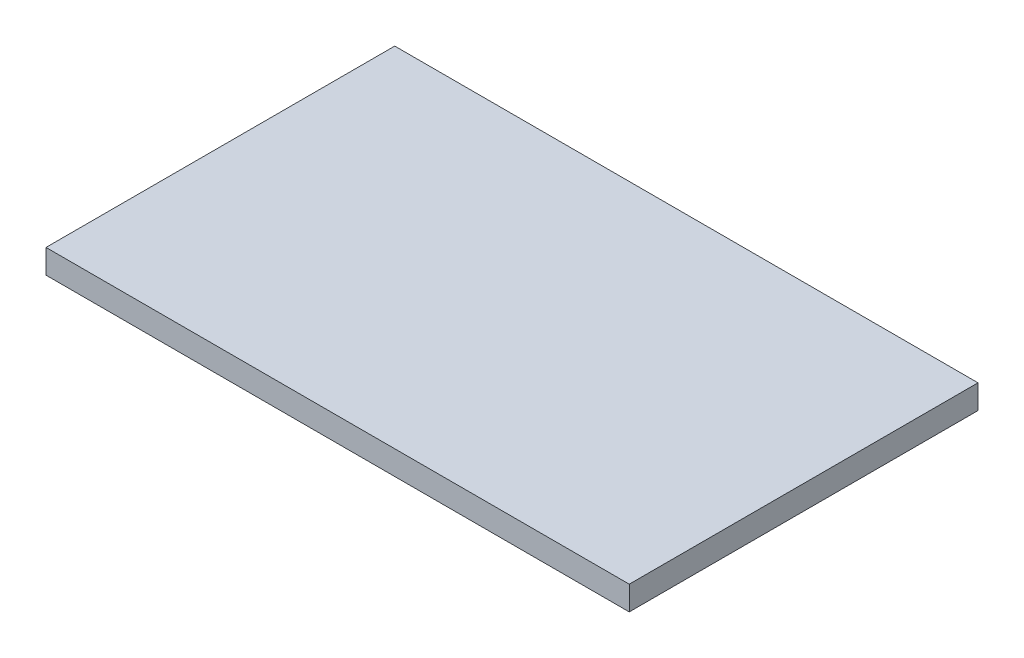
ISO-10303-21;
HEADER;
FILE_DESCRIPTION(('STEP AP214'),'2;1');
FILE_NAME('part.step','',(''),(''),'','','');
FILE_SCHEMA(('AUTOMOTIVE_DESIGN { 1 0 10303 214 1 1 1 1 }'));
ENDSEC;
DATA;
#1=APPLICATION_CONTEXT('core data for automotive mechanical design processes');
#2=APPLICATION_PROTOCOL_DEFINITION('international standard','automotive_design',2000,#1);
#3=PRODUCT_CONTEXT('',#1,'mechanical');
#4=PRODUCT('Part','Part','',(#3));
#5=PRODUCT_RELATED_PRODUCT_CATEGORY('part','',(#4));
#6=PRODUCT_DEFINITION_FORMATION('','',#4);
#7=PRODUCT_DEFINITION_CONTEXT('part definition',#1,'design');
#8=PRODUCT_DEFINITION('design','',#6,#7);
#9=PRODUCT_DEFINITION_SHAPE('','',#8);
#10=(LENGTH_UNIT() NAMED_UNIT(*) SI_UNIT(.MILLI.,.METRE.));
#11=(NAMED_UNIT(*) PLANE_ANGLE_UNIT() SI_UNIT($,.RADIAN.));
#12=(NAMED_UNIT(*) SI_UNIT($,.STERADIAN.) SOLID_ANGLE_UNIT());
#13=UNCERTAINTY_MEASURE_WITH_UNIT(LENGTH_MEASURE(1.E-05),#10,'distance_accuracy_value','');
#14=(GEOMETRIC_REPRESENTATION_CONTEXT(3) GLOBAL_UNCERTAINTY_ASSIGNED_CONTEXT((#13)) GLOBAL_UNIT_ASSIGNED_CONTEXT((#10,
#11,#12)) REPRESENTATION_CONTEXT('',''));
#15=CARTESIAN_POINT('',(0.,0.,0.));
#16=DIRECTION('',(0.,0.,1.));
#17=DIRECTION('',(1.,0.,0.));
#18=AXIS2_PLACEMENT_3D('',#15,#16,#17);
#19=CARTESIAN_POINT('',(0.,2.,0.));
#20=DIRECTION('',(1.,0.,0.));
#21=DIRECTION('',(0.,0.,-1.));
#22=AXIS2_PLACEMENT_3D('',#19,#20,#21);
#23=PLANE('',#22);
#24=DIRECTION('',(0.,0.,1.));
#25=VECTOR('',#24,1.);
#26=CARTESIAN_POINT('',(0.,0.,0.));
#27=LINE('',#26,#25);
#28=CARTESIAN_POINT('',(0.,0.,0.));
#29=VERTEX_POINT('',#28);
#30=CARTESIAN_POINT('',(0.,0.,29.));
#31=VERTEX_POINT('',#30);
#32=EDGE_CURVE('E96',#29,#31,#27,.T.);
#33=ORIENTED_EDGE('',*,*,#32,.T.);
#34=DIRECTION('',(0.,-1.,0.));
#35=VECTOR('',#34,1.);
#36=CARTESIAN_POINT('',(0.,2.,29.));
#37=LINE('',#36,#35);
#38=CARTESIAN_POINT('',(0.,2.,29.));
#39=VERTEX_POINT('',#38);
#40=EDGE_CURVE('E11',#39,#31,#37,.T.);
#41=ORIENTED_EDGE('',*,*,#40,.F.);
#42=DIRECTION('',(0.,0.,1.));
#43=VECTOR('',#42,1.);
#44=CARTESIAN_POINT('',(0.,2.,0.));
#45=LINE('',#44,#43);
#46=CARTESIAN_POINT('',(0.,2.,0.));
#47=VERTEX_POINT('',#46);
#48=EDGE_CURVE('E84',#47,#39,#45,.T.);
#49=ORIENTED_EDGE('',*,*,#48,.F.);
#50=DIRECTION('',(0.,-1.,0.));
#51=VECTOR('',#50,1.);
#52=CARTESIAN_POINT('',(0.,2.,0.));
#53=LINE('',#52,#51);
#54=EDGE_CURVE('E92',#47,#29,#53,.T.);
#55=ORIENTED_EDGE('',*,*,#54,.T.);
#56=EDGE_LOOP('',(#33,#41,#49,#55));
#57=FACE_BOUND('',#56,.T.);
#58=ADVANCED_FACE('F33',(#57),#23,.F.);
#59=CARTESIAN_POINT('',(0.,2.,29.));
#60=DIRECTION('',(0.,0.,-1.));
#61=DIRECTION('',(-1.,0.,0.));
#62=AXIS2_PLACEMENT_3D('',#59,#60,#61);
#63=PLANE('',#62);
#64=DIRECTION('',(1.,0.,0.));
#65=VECTOR('',#64,1.);
#66=CARTESIAN_POINT('',(0.,0.,29.));
#67=LINE('',#66,#65);
#68=CARTESIAN_POINT('',(48.5,0.,29.));
#69=VERTEX_POINT('',#68);
#70=EDGE_CURVE('E88',#31,#69,#67,.T.);
#71=ORIENTED_EDGE('',*,*,#70,.T.);
#72=DIRECTION('',(0.,-1.,0.));
#73=VECTOR('',#72,1.);
#74=CARTESIAN_POINT('',(48.5,2.,29.));
#75=LINE('',#74,#73);
#76=CARTESIAN_POINT('',(48.5,2.,29.));
#77=VERTEX_POINT('',#76);
#78=EDGE_CURVE('E41',#77,#69,#75,.T.);
#79=ORIENTED_EDGE('',*,*,#78,.F.);
#80=DIRECTION('',(1.,0.,0.));
#81=VECTOR('',#80,1.);
#82=CARTESIAN_POINT('',(0.,2.,29.));
#83=LINE('',#82,#81);
#84=EDGE_CURVE('E79',#39,#77,#83,.T.);
#85=ORIENTED_EDGE('',*,*,#84,.F.);
#86=ORIENTED_EDGE('',*,*,#40,.T.);
#87=EDGE_LOOP('',(#71,#79,#85,#86));
#88=FACE_BOUND('',#87,.T.);
#89=ADVANCED_FACE('F87',(#88),#63,.F.);
#90=CARTESIAN_POINT('',(48.5,2.,0.));
#91=DIRECTION('',(-1.,0.,0.));
#92=DIRECTION('',(0.,0.,1.));
#93=AXIS2_PLACEMENT_3D('',#90,#91,#92);
#94=PLANE('',#93);
#95=DIRECTION('',(0.,0.,-1.));
#96=VECTOR('',#95,1.);
#97=CARTESIAN_POINT('',(48.5,0.,0.));
#98=LINE('',#97,#96);
#99=CARTESIAN_POINT('',(48.5,0.,0.));
#100=VERTEX_POINT('',#99);
#101=EDGE_CURVE('E66',#69,#100,#98,.T.);
#102=ORIENTED_EDGE('',*,*,#101,.T.);
#103=DIRECTION('',(0.,-1.,0.));
#104=VECTOR('',#103,1.);
#105=CARTESIAN_POINT('',(48.5,2.,0.));
#106=LINE('',#105,#104);
#107=CARTESIAN_POINT('',(48.5,2.,0.));
#108=VERTEX_POINT('',#107);
#109=EDGE_CURVE('E89',#108,#100,#106,.T.);
#110=ORIENTED_EDGE('',*,*,#109,.F.);
#111=DIRECTION('',(0.,0.,-1.));
#112=VECTOR('',#111,1.);
#113=CARTESIAN_POINT('',(48.5,2.,0.));
#114=LINE('',#113,#112);
#115=EDGE_CURVE('E82',#77,#108,#114,.T.);
#116=ORIENTED_EDGE('',*,*,#115,.F.);
#117=ORIENTED_EDGE('',*,*,#78,.T.);
#118=EDGE_LOOP('',(#102,#110,#116,#117));
#119=FACE_BOUND('',#118,.T.);
#120=ADVANCED_FACE('F90',(#119),#94,.F.);
#121=CARTESIAN_POINT('',(0.,2.,0.));
#122=DIRECTION('',(0.,0.,1.));
#123=DIRECTION('',(1.,0.,0.));
#124=AXIS2_PLACEMENT_3D('',#121,#122,#123);
#125=PLANE('',#124);
#126=DIRECTION('',(-1.,0.,0.));
#127=VECTOR('',#126,1.);
#128=CARTESIAN_POINT('',(0.,0.,0.));
#129=LINE('',#128,#127);
#130=EDGE_CURVE('E72',#100,#29,#129,.T.);
#131=ORIENTED_EDGE('',*,*,#130,.T.);
#132=ORIENTED_EDGE('',*,*,#54,.F.);
#133=DIRECTION('',(-1.,0.,0.));
#134=VECTOR('',#133,1.);
#135=CARTESIAN_POINT('',(0.,2.,0.));
#136=LINE('',#135,#134);
#137=EDGE_CURVE('E49',#108,#47,#136,.T.);
#138=ORIENTED_EDGE('',*,*,#137,.F.);
#139=ORIENTED_EDGE('',*,*,#109,.T.);
#140=EDGE_LOOP('',(#131,#132,#138,#139));
#141=FACE_BOUND('',#140,.T.);
#142=ADVANCED_FACE('F103',(#141),#125,.F.);
#143=CARTESIAN_POINT('',(0.,2.,0.));
#144=DIRECTION('',(0.,1.,0.));
#145=DIRECTION('',(0.,0.,1.));
#146=AXIS2_PLACEMENT_3D('',#143,#144,#145);
#147=PLANE('',#146);
#148=ORIENTED_EDGE('',*,*,#48,.T.);
#149=ORIENTED_EDGE('',*,*,#84,.T.);
#150=ORIENTED_EDGE('',*,*,#115,.T.);
#151=ORIENTED_EDGE('',*,*,#137,.T.);
#152=EDGE_LOOP('',(#148,#149,#150,#151));
#153=FACE_BOUND('',#152,.T.);
#154=ADVANCED_FACE('F80',(#153),#147,.T.);
#155=CARTESIAN_POINT('',(0.,0.,0.));
#156=DIRECTION('',(0.,1.,0.));
#157=DIRECTION('',(0.,0.,1.));
#158=AXIS2_PLACEMENT_3D('',#155,#156,#157);
#159=PLANE('',#158);
#160=ORIENTED_EDGE('',*,*,#32,.F.);
#161=ORIENTED_EDGE('',*,*,#130,.F.);
#162=ORIENTED_EDGE('',*,*,#101,.F.);
#163=ORIENTED_EDGE('',*,*,#70,.F.);
#164=EDGE_LOOP('',(#160,#161,#162,#163));
#165=FACE_BOUND('',#164,.T.);
#166=ADVANCED_FACE('F106',(#165),#159,.F.);
#167=CLOSED_SHELL('',(#58,#89,#120,#142,#154,#166));
#168=MANIFOLD_SOLID_BREP('B2',#167);
#169=ADVANCED_BREP_SHAPE_REPRESENTATION('',(#18,#168),#14);
#170=SHAPE_DEFINITION_REPRESENTATION(#9,#169);
ENDSEC;
END-ISO-10303-21;
